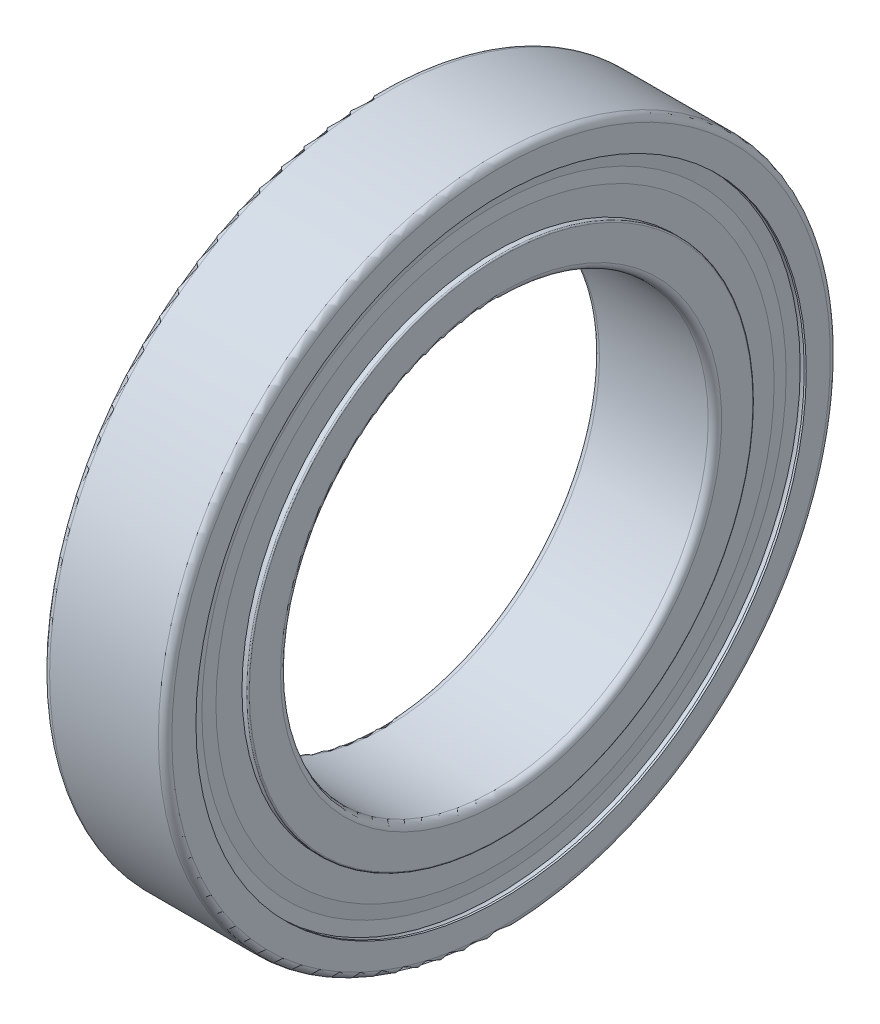
ISO-10303-21;
HEADER;
FILE_DESCRIPTION(('STEP AP214'),'2;1');
FILE_NAME('part.step','',(''),(''),'','','');
FILE_SCHEMA(('AUTOMOTIVE_DESIGN { 1 0 10303 214 1 1 1 1 }'));
ENDSEC;
DATA;
#1=APPLICATION_CONTEXT('core data for automotive mechanical design processes');
#2=APPLICATION_PROTOCOL_DEFINITION('international standard','automotive_design',2000,#1);
#3=PRODUCT_CONTEXT('',#1,'mechanical');
#4=PRODUCT('Part','Part','',(#3));
#5=PRODUCT_RELATED_PRODUCT_CATEGORY('part','',(#4));
#6=PRODUCT_DEFINITION_FORMATION('','',#4);
#7=PRODUCT_DEFINITION_CONTEXT('part definition',#1,'design');
#8=PRODUCT_DEFINITION('design','',#6,#7);
#9=PRODUCT_DEFINITION_SHAPE('','',#8);
#10=(LENGTH_UNIT() NAMED_UNIT(*) SI_UNIT(.MILLI.,.METRE.));
#11=(NAMED_UNIT(*) PLANE_ANGLE_UNIT() SI_UNIT($,.RADIAN.));
#12=(NAMED_UNIT(*) SI_UNIT($,.STERADIAN.) SOLID_ANGLE_UNIT());
#13=UNCERTAINTY_MEASURE_WITH_UNIT(LENGTH_MEASURE(1.E-05),#10,'distance_accuracy_value','');
#14=(GEOMETRIC_REPRESENTATION_CONTEXT(3) GLOBAL_UNCERTAINTY_ASSIGNED_CONTEXT((#13)) GLOBAL_UNIT_ASSIGNED_CONTEXT((#10,
#11,#12)) REPRESENTATION_CONTEXT('',''));
#15=CARTESIAN_POINT('',(0.,0.,0.));
#16=DIRECTION('',(0.,0.,1.));
#17=DIRECTION('',(1.,0.,0.));
#18=AXIS2_PLACEMENT_3D('',#15,#16,#17);
#19=CARTESIAN_POINT('',(10.,40.5435990556089,-19.5247682602901));
#20=DIRECTION('',(1.,0.,0.));
#21=DIRECTION('',(0.,-0.900968867902419,0.433883739117558));
#22=AXIS2_PLACEMENT_3D('',#19,#20,#21);
#23=SPHERICAL_SURFACE('',#22,5.953);
#24=CARTESIAN_POINT('',(15.953,40.5435990556089,-19.5247682602901));
#25=VERTEX_POINT('',#24);
#26=VERTEX_LOOP('',#25);
#27=FACE_BOUND('',#26,.T.);
#28=CARTESIAN_POINT('',(4.047,40.5435990556089,-19.5247682602901));
#29=VERTEX_POINT('',#28);
#30=VERTEX_LOOP('',#29);
#31=FACE_BOUND('',#30,.T.);
#32=ADVANCED_FACE('F46',(#27,#31),#23,.T.);
#33=CLOSED_SHELL('',(#32));
#34=MANIFOLD_SOLID_BREP('B2',#33);
#35=CARTESIAN_POINT('',(10.,28.057041083643,-35.1824167110614));
#36=DIRECTION('',(1.,0.,0.));
#37=DIRECTION('',(0.,-0.623489801858733,0.78183148246803));
#38=AXIS2_PLACEMENT_3D('',#35,#36,#37);
#39=SPHERICAL_SURFACE('',#38,5.953);
#40=CARTESIAN_POINT('',(15.953,28.057041083643,-35.1824167110614));
#41=VERTEX_POINT('',#40);
#42=VERTEX_LOOP('',#41);
#43=FACE_BOUND('',#42,.T.);
#44=CARTESIAN_POINT('',(4.047,28.057041083643,-35.1824167110614));
#45=VERTEX_POINT('',#44);
#46=VERTEX_LOOP('',#45);
#47=FACE_BOUND('',#46,.T.);
#48=ADVANCED_FACE('F73',(#43,#47),#39,.T.);
#49=CLOSED_SHELL('',(#48));
#50=MANIFOLD_SOLID_BREP('B6',#49);
#51=CARTESIAN_POINT('',(10.,10.0134420280342,-43.871756048182));
#52=DIRECTION('',(1.,0.,0.));
#53=DIRECTION('',(0.,-0.222520933956315,0.974927912181824));
#54=AXIS2_PLACEMENT_3D('',#51,#52,#53);
#55=SPHERICAL_SURFACE('',#54,5.953);
#56=CARTESIAN_POINT('',(15.953,10.0134420280342,-43.871756048182));
#57=VERTEX_POINT('',#56);
#58=VERTEX_LOOP('',#57);
#59=FACE_BOUND('',#58,.T.);
#60=CARTESIAN_POINT('',(4.047,10.0134420280342,-43.871756048182));
#61=VERTEX_POINT('',#60);
#62=VERTEX_LOOP('',#61);
#63=FACE_BOUND('',#62,.T.);
#64=ADVANCED_FACE('F100',(#59,#63),#55,.T.);
#65=CLOSED_SHELL('',(#64));
#66=MANIFOLD_SOLID_BREP('B40',#65);
#67=CARTESIAN_POINT('',(10.,-10.0134420280341,-43.8717560481821));
#68=DIRECTION('',(1.,0.,0.));
#69=DIRECTION('',(0.,0.222520933956314,0.974927912181824));
#70=AXIS2_PLACEMENT_3D('',#67,#68,#69);
#71=SPHERICAL_SURFACE('',#70,5.953);
#72=CARTESIAN_POINT('',(15.953,-10.0134420280341,-43.8717560481821));
#73=VERTEX_POINT('',#72);
#74=VERTEX_LOOP('',#73);
#75=FACE_BOUND('',#74,.T.);
#76=CARTESIAN_POINT('',(4.047,-10.0134420280341,-43.8717560481821));
#77=VERTEX_POINT('',#76);
#78=VERTEX_LOOP('',#77);
#79=FACE_BOUND('',#78,.T.);
#80=ADVANCED_FACE('F127',(#75,#79),#71,.T.);
#81=CLOSED_SHELL('',(#80));
#82=MANIFOLD_SOLID_BREP('B67',#81);
#83=CARTESIAN_POINT('',(10.,-28.057041083643,-35.1824167110613));
#84=DIRECTION('',(1.,0.,0.));
#85=DIRECTION('',(0.,0.623489801858734,0.78183148246803));
#86=AXIS2_PLACEMENT_3D('',#83,#84,#85);
#87=SPHERICAL_SURFACE('',#86,5.953);
#88=CARTESIAN_POINT('',(15.953,-28.057041083643,-35.1824167110613));
#89=VERTEX_POINT('',#88);
#90=VERTEX_LOOP('',#89);
#91=FACE_BOUND('',#90,.T.);
#92=CARTESIAN_POINT('',(4.047,-28.057041083643,-35.1824167110613));
#93=VERTEX_POINT('',#92);
#94=VERTEX_LOOP('',#93);
#95=FACE_BOUND('',#94,.T.);
#96=ADVANCED_FACE('F154',(#91,#95),#87,.T.);
#97=CLOSED_SHELL('',(#96));
#98=MANIFOLD_SOLID_BREP('B94',#97);
#99=CARTESIAN_POINT('',(10.,-40.5435990556089,-19.5247682602901));
#100=DIRECTION('',(1.,0.,0.));
#101=DIRECTION('',(0.,0.900968867902419,0.433883739117558));
#102=AXIS2_PLACEMENT_3D('',#99,#100,#101);
#103=SPHERICAL_SURFACE('',#102,5.953);
#104=CARTESIAN_POINT('',(15.953,-40.5435990556089,-19.5247682602901));
#105=VERTEX_POINT('',#104);
#106=VERTEX_LOOP('',#105);
#107=FACE_BOUND('',#106,.T.);
#108=CARTESIAN_POINT('',(4.047,-40.5435990556089,-19.5247682602901));
#109=VERTEX_POINT('',#108);
#110=VERTEX_LOOP('',#109);
#111=FACE_BOUND('',#110,.T.);
#112=ADVANCED_FACE('F181',(#107,#111),#103,.T.);
#113=CLOSED_SHELL('',(#112));
#114=MANIFOLD_SOLID_BREP('B121',#113);
#115=CARTESIAN_POINT('',(10.,-45.,0.));
#116=DIRECTION('',(1.,0.,0.));
#117=DIRECTION('',(0.,1.,0.));
#118=AXIS2_PLACEMENT_3D('',#115,#116,#117);
#119=SPHERICAL_SURFACE('',#118,5.953);
#120=CARTESIAN_POINT('',(15.953,-45.,0.));
#121=VERTEX_POINT('',#120);
#122=VERTEX_LOOP('',#121);
#123=FACE_BOUND('',#122,.T.);
#124=CARTESIAN_POINT('',(4.047,-45.,0.));
#125=VERTEX_POINT('',#124);
#126=VERTEX_LOOP('',#125);
#127=FACE_BOUND('',#126,.T.);
#128=ADVANCED_FACE('F208',(#123,#127),#119,.T.);
#129=CLOSED_SHELL('',(#128));
#130=MANIFOLD_SOLID_BREP('B148',#129);
#131=CARTESIAN_POINT('',(10.,-40.5435990556089,19.5247682602901));
#132=DIRECTION('',(1.,0.,0.));
#133=DIRECTION('',(0.,0.900968867902419,-0.433883739117558));
#134=AXIS2_PLACEMENT_3D('',#131,#132,#133);
#135=SPHERICAL_SURFACE('',#134,5.953);
#136=CARTESIAN_POINT('',(15.953,-40.5435990556089,19.5247682602901));
#137=VERTEX_POINT('',#136);
#138=VERTEX_LOOP('',#137);
#139=FACE_BOUND('',#138,.T.);
#140=CARTESIAN_POINT('',(4.047,-40.5435990556089,19.5247682602901));
#141=VERTEX_POINT('',#140);
#142=VERTEX_LOOP('',#141);
#143=FACE_BOUND('',#142,.T.);
#144=ADVANCED_FACE('F235',(#139,#143),#135,.T.);
#145=CLOSED_SHELL('',(#144));
#146=MANIFOLD_SOLID_BREP('B175',#145);
#147=CARTESIAN_POINT('',(10.,-28.057041083643,35.1824167110613));
#148=DIRECTION('',(1.,0.,0.));
#149=DIRECTION('',(0.,0.623489801858734,-0.78183148246803));
#150=AXIS2_PLACEMENT_3D('',#147,#148,#149);
#151=SPHERICAL_SURFACE('',#150,5.953);
#152=CARTESIAN_POINT('',(15.953,-28.057041083643,35.1824167110613));
#153=VERTEX_POINT('',#152);
#154=VERTEX_LOOP('',#153);
#155=FACE_BOUND('',#154,.T.);
#156=CARTESIAN_POINT('',(4.047,-28.057041083643,35.1824167110613));
#157=VERTEX_POINT('',#156);
#158=VERTEX_LOOP('',#157);
#159=FACE_BOUND('',#158,.T.);
#160=ADVANCED_FACE('F262',(#155,#159),#151,.T.);
#161=CLOSED_SHELL('',(#160));
#162=MANIFOLD_SOLID_BREP('B202',#161);
#163=CARTESIAN_POINT('',(10.,-10.0134420280341,43.8717560481821));
#164=DIRECTION('',(1.,0.,0.));
#165=DIRECTION('',(0.,0.222520933956314,-0.974927912181824));
#166=AXIS2_PLACEMENT_3D('',#163,#164,#165);
#167=SPHERICAL_SURFACE('',#166,5.953);
#168=CARTESIAN_POINT('',(15.953,-10.0134420280341,43.8717560481821));
#169=VERTEX_POINT('',#168);
#170=VERTEX_LOOP('',#169);
#171=FACE_BOUND('',#170,.T.);
#172=CARTESIAN_POINT('',(4.047,-10.0134420280341,43.8717560481821));
#173=VERTEX_POINT('',#172);
#174=VERTEX_LOOP('',#173);
#175=FACE_BOUND('',#174,.T.);
#176=ADVANCED_FACE('F289',(#171,#175),#167,.T.);
#177=CLOSED_SHELL('',(#176));
#178=MANIFOLD_SOLID_BREP('B229',#177);
#179=CARTESIAN_POINT('',(10.,10.0134420280341,43.8717560481821));
#180=DIRECTION('',(1.,0.,0.));
#181=DIRECTION('',(0.,-0.222520933956314,-0.974927912181824));
#182=AXIS2_PLACEMENT_3D('',#179,#180,#181);
#183=SPHERICAL_SURFACE('',#182,5.953);
#184=CARTESIAN_POINT('',(15.953,10.0134420280341,43.8717560481821));
#185=VERTEX_POINT('',#184);
#186=VERTEX_LOOP('',#185);
#187=FACE_BOUND('',#186,.T.);
#188=CARTESIAN_POINT('',(4.047,10.0134420280341,43.8717560481821));
#189=VERTEX_POINT('',#188);
#190=VERTEX_LOOP('',#189);
#191=FACE_BOUND('',#190,.T.);
#192=ADVANCED_FACE('F316',(#187,#191),#183,.T.);
#193=CLOSED_SHELL('',(#192));
#194=MANIFOLD_SOLID_BREP('B256',#193);
#195=CARTESIAN_POINT('',(10.,28.057041083643,35.1824167110613));
#196=DIRECTION('',(1.,0.,0.));
#197=DIRECTION('',(0.,-0.623489801858734,-0.78183148246803));
#198=AXIS2_PLACEMENT_3D('',#195,#196,#197);
#199=SPHERICAL_SURFACE('',#198,5.953);
#200=CARTESIAN_POINT('',(15.953,28.057041083643,35.1824167110613));
#201=VERTEX_POINT('',#200);
#202=VERTEX_LOOP('',#201);
#203=FACE_BOUND('',#202,.T.);
#204=CARTESIAN_POINT('',(4.047,28.057041083643,35.1824167110613));
#205=VERTEX_POINT('',#204);
#206=VERTEX_LOOP('',#205);
#207=FACE_BOUND('',#206,.T.);
#208=ADVANCED_FACE('F343',(#203,#207),#199,.T.);
#209=CLOSED_SHELL('',(#208));
#210=MANIFOLD_SOLID_BREP('B283',#209);
#211=CARTESIAN_POINT('',(10.,40.5435990556089,19.5247682602901));
#212=DIRECTION('',(1.,0.,0.));
#213=DIRECTION('',(0.,-0.900968867902419,-0.433883739117558));
#214=AXIS2_PLACEMENT_3D('',#211,#212,#213);
#215=SPHERICAL_SURFACE('',#214,5.953);
#216=CARTESIAN_POINT('',(15.953,40.5435990556089,19.5247682602901));
#217=VERTEX_POINT('',#216);
#218=VERTEX_LOOP('',#217);
#219=FACE_BOUND('',#218,.T.);
#220=CARTESIAN_POINT('',(4.047,40.5435990556089,19.5247682602901));
#221=VERTEX_POINT('',#220);
#222=VERTEX_LOOP('',#221);
#223=FACE_BOUND('',#222,.T.);
#224=ADVANCED_FACE('F370',(#219,#223),#215,.T.);
#225=CLOSED_SHELL('',(#224));
#226=MANIFOLD_SOLID_BREP('B310',#225);
#227=CARTESIAN_POINT('',(10.,45.,0.));
#228=DIRECTION('',(1.,0.,0.));
#229=DIRECTION('',(0.,-1.,0.));
#230=AXIS2_PLACEMENT_3D('',#227,#228,#229);
#231=SPHERICAL_SURFACE('',#230,5.953);
#232=CARTESIAN_POINT('',(15.953,45.,0.));
#233=VERTEX_POINT('',#232);
#234=VERTEX_LOOP('',#233);
#235=FACE_BOUND('',#234,.T.);
#236=CARTESIAN_POINT('',(4.047,45.,0.));
#237=VERTEX_POINT('',#236);
#238=VERTEX_LOOP('',#237);
#239=FACE_BOUND('',#238,.T.);
#240=ADVANCED_FACE('F399',(#235,#239),#231,.T.);
#241=CLOSED_SHELL('',(#240));
#242=MANIFOLD_SOLID_BREP('B337',#241);
#243=CARTESIAN_POINT('',(1.1,0.,0.));
#244=DIRECTION('',(1.,0.,0.));
#245=DIRECTION('',(0.,0.,1.));
#246=AXIS2_PLACEMENT_3D('',#243,#244,#245);
#247=TOROIDAL_SURFACE('',#246,53.9,1.1);
#248=CARTESIAN_POINT('',(1.1,0.,0.));
#249=DIRECTION('',(-1.,0.,0.));
#250=DIRECTION('',(0.,0.,1.));
#251=AXIS2_PLACEMENT_3D('',#248,#249,#250);
#252=CIRCLE('',#251,55.);
#253=CARTESIAN_POINT('',(1.1,0.,55.));
#254=VERTEX_POINT('',#253);
#255=EDGE_CURVE('E444',#254,#254,#252,.T.);
#256=ORIENTED_EDGE('',*,*,#255,.T.);
#257=EDGE_LOOP('',(#256));
#258=FACE_BOUND('',#257,.T.);
#259=CARTESIAN_POINT('',(0.,0.,0.));
#260=DIRECTION('',(-1.,0.,0.));
#261=DIRECTION('',(0.,0.,1.));
#262=AXIS2_PLACEMENT_3D('',#259,#260,#261);
#263=CIRCLE('',#262,53.9);
#264=CARTESIAN_POINT('',(0.,0.,53.9));
#265=VERTEX_POINT('',#264);
#266=EDGE_CURVE('E397',#265,#265,#263,.T.);
#267=ORIENTED_EDGE('',*,*,#266,.F.);
#268=EDGE_LOOP('',(#267));
#269=FACE_BOUND('',#268,.T.);
#270=ADVANCED_FACE('F427',(#258,#269),#247,.T.);
#271=CARTESIAN_POINT('',(0.,53.9,0.));
#272=DIRECTION('',(-1.,0.,0.));
#273=DIRECTION('',(0.,0.,-1.));
#274=AXIS2_PLACEMENT_3D('',#271,#272,#273);
#275=PLANE('',#274);
#276=ORIENTED_EDGE('',*,*,#266,.T.);
#277=EDGE_LOOP('',(#276));
#278=FACE_BOUND('',#277,.T.);
#279=CARTESIAN_POINT('',(0.,0.,0.));
#280=DIRECTION('',(-1.,0.,0.));
#281=DIRECTION('',(0.,0.,1.));
#282=AXIS2_PLACEMENT_3D('',#279,#280,#281);
#283=CIRCLE('',#282,49.95);
#284=CARTESIAN_POINT('',(0.,0.,49.95));
#285=VERTEX_POINT('',#284);
#286=EDGE_CURVE('E437',#285,#285,#283,.T.);
#287=ORIENTED_EDGE('',*,*,#286,.F.);
#288=EDGE_LOOP('',(#287));
#289=FACE_BOUND('',#288,.T.);
#290=ADVANCED_FACE('F545',(#278,#289),#275,.T.);
#291=CARTESIAN_POINT('',(50.,0.,0.));
#292=DIRECTION('',(-1.,0.,0.));
#293=DIRECTION('',(0.,0.,1.));
#294=AXIS2_PLACEMENT_3D('',#291,#292,#293);
#295=CYLINDRICAL_SURFACE('',#294,49.95);
#296=ORIENTED_EDGE('',*,*,#286,.T.);
#297=EDGE_LOOP('',(#296));
#298=FACE_BOUND('',#297,.T.);
#299=CARTESIAN_POINT('',(0.33,0.,0.));
#300=DIRECTION('',(-1.,0.,0.));
#301=DIRECTION('',(0.,0.,1.));
#302=AXIS2_PLACEMENT_3D('',#299,#300,#301);
#303=CIRCLE('',#302,49.95);
#304=CARTESIAN_POINT('',(0.33,0.,49.95));
#305=VERTEX_POINT('',#304);
#306=EDGE_CURVE('E507',#305,#305,#303,.T.);
#307=ORIENTED_EDGE('',*,*,#306,.F.);
#308=EDGE_LOOP('',(#307));
#309=FACE_BOUND('',#308,.T.);
#310=ADVANCED_FACE('F539',(#298,#309),#295,.F.);
#311=CARTESIAN_POINT('',(0.99,0.,0.));
#312=DIRECTION('',(1.,0.,0.));
#313=DIRECTION('',(0.,0.,1.));
#314=AXIS2_PLACEMENT_3D('',#311,#312,#313);
#315=TOROIDAL_SURFACE('',#314,49.9499999833,0.66);
#316=CARTESIAN_POINT('',(1.65,0.,0.));
#317=DIRECTION('',(-1.,0.,0.));
#318=DIRECTION('',(0.,0.,1.));
#319=AXIS2_PLACEMENT_3D('',#316,#317,#318);
#320=CIRCLE('',#319,49.95);
#321=CARTESIAN_POINT('',(1.65,0.,49.95));
#322=VERTEX_POINT('',#321);
#323=EDGE_CURVE('E509',#322,#322,#320,.T.);
#324=ORIENTED_EDGE('',*,*,#323,.F.);
#325=EDGE_LOOP('',(#324));
#326=FACE_BOUND('',#325,.T.);
#327=ORIENTED_EDGE('',*,*,#306,.T.);
#328=EDGE_LOOP('',(#327));
#329=FACE_BOUND('',#328,.T.);
#330=CARTESIAN_POINT('',(0.99,0.,50.60999998334));
#331=VERTEX_POINT('',#330);
#332=VERTEX_LOOP('',#331);
#333=FACE_BOUND('',#332,.T.);
#334=ADVANCED_FACE('F531',(#326,#329,#333),#315,.F.);
#335=CARTESIAN_POINT('',(1.65,0.,0.));
#336=DIRECTION('',(-1.,0.,0.));
#337=DIRECTION('',(0.,0.,-1.));
#338=AXIS2_PLACEMENT_3D('',#335,#336,#337);
#339=CONICAL_SURFACE('',#338,49.95,1.3962634016);
#340=ORIENTED_EDGE('',*,*,#323,.T.);
#341=EDGE_LOOP('',(#340));
#342=FACE_BOUND('',#341,.T.);
#343=CARTESIAN_POINT('',(1.81945022846084,0.,0.));
#344=DIRECTION('',(-1.,0.,0.));
#345=DIRECTION('',(0.,0.,1.));
#346=AXIS2_PLACEMENT_3D('',#343,#344,#345);
#347=CIRCLE('',#346,48.989);
#348=CARTESIAN_POINT('',(1.81945022846084,0.,48.989));
#349=VERTEX_POINT('',#348);
#350=EDGE_CURVE('E505',#349,#349,#347,.T.);
#351=ORIENTED_EDGE('',*,*,#350,.F.);
#352=EDGE_LOOP('',(#351));
#353=FACE_BOUND('',#352,.T.);
#354=ADVANCED_FACE('F529',(#342,#353),#339,.F.);
#355=CARTESIAN_POINT('',(50.,0.,0.));
#356=DIRECTION('',(-1.,0.,0.));
#357=DIRECTION('',(0.,0.,1.));
#358=AXIS2_PLACEMENT_3D('',#355,#356,#357);
#359=CYLINDRICAL_SURFACE('',#358,48.989);
#360=ORIENTED_EDGE('',*,*,#350,.T.);
#361=EDGE_LOOP('',(#360));
#362=FACE_BOUND('',#361,.T.);
#363=CARTESIAN_POINT('',(5.58116666980978,0.,0.));
#364=DIRECTION('',(-1.,0.,0.));
#365=DIRECTION('',(0.,0.,1.));
#366=AXIS2_PLACEMENT_3D('',#363,#364,#365);
#367=CIRCLE('',#366,48.989);
#368=CARTESIAN_POINT('',(5.58116666980978,0.,48.989));
#369=VERTEX_POINT('',#368);
#370=EDGE_CURVE('E510',#369,#369,#367,.T.);
#371=ORIENTED_EDGE('',*,*,#370,.F.);
#372=EDGE_LOOP('',(#371));
#373=FACE_BOUND('',#372,.T.);
#374=ADVANCED_FACE('F526',(#362,#373),#359,.F.);
#375=CARTESIAN_POINT('',(10.,0.,0.));
#376=DIRECTION('',(1.,0.,0.));
#377=DIRECTION('',(0.,0.,1.));
#378=AXIS2_PLACEMENT_3D('',#375,#376,#377);
#379=TOROIDAL_SURFACE('',#378,45.,5.953);
#380=CARTESIAN_POINT('',(14.4188333301902,0.,0.));
#381=DIRECTION('',(-1.,0.,0.));
#382=DIRECTION('',(0.,0.,1.));
#383=AXIS2_PLACEMENT_3D('',#380,#381,#382);
#384=CIRCLE('',#383,48.989);
#385=CARTESIAN_POINT('',(14.4188333301902,0.,48.989));
#386=VERTEX_POINT('',#385);
#387=EDGE_CURVE('E468',#386,#386,#384,.T.);
#388=ORIENTED_EDGE('',*,*,#387,.F.);
#389=EDGE_LOOP('',(#388));
#390=FACE_BOUND('',#389,.T.);
#391=ORIENTED_EDGE('',*,*,#370,.T.);
#392=EDGE_LOOP('',(#391));
#393=FACE_BOUND('',#392,.T.);
#394=CARTESIAN_POINT('',(10.,0.,50.953));
#395=VERTEX_POINT('',#394);
#396=VERTEX_LOOP('',#395);
#397=FACE_BOUND('',#396,.T.);
#398=ADVANCED_FACE('F537',(#390,#393,#397),#379,.F.);
#399=CARTESIAN_POINT('',(50.,0.,0.));
#400=DIRECTION('',(-1.,0.,0.));
#401=DIRECTION('',(0.,0.,1.));
#402=AXIS2_PLACEMENT_3D('',#399,#400,#401);
#403=CYLINDRICAL_SURFACE('',#402,48.989);
#404=ORIENTED_EDGE('',*,*,#387,.T.);
#405=EDGE_LOOP('',(#404));
#406=FACE_BOUND('',#405,.T.);
#407=CARTESIAN_POINT('',(18.1805497715392,0.,0.));
#408=DIRECTION('',(-1.,0.,0.));
#409=DIRECTION('',(0.,0.,1.));
#410=AXIS2_PLACEMENT_3D('',#407,#408,#409);
#411=CIRCLE('',#410,48.989);
#412=CARTESIAN_POINT('',(18.1805497715392,0.,48.989));
#413=VERTEX_POINT('',#412);
#414=EDGE_CURVE('E511',#413,#413,#411,.T.);
#415=ORIENTED_EDGE('',*,*,#414,.F.);
#416=EDGE_LOOP('',(#415));
#417=FACE_BOUND('',#416,.T.);
#418=ADVANCED_FACE('F429',(#406,#417),#403,.F.);
#419=CARTESIAN_POINT('',(18.1805497715392,0.,0.));
#420=DIRECTION('',(1.,0.,0.));
#421=DIRECTION('',(0.,0.,1.));
#422=AXIS2_PLACEMENT_3D('',#419,#420,#421);
#423=CONICAL_SURFACE('',#422,48.989,1.3962634016);
#424=CARTESIAN_POINT('',(18.35,0.,0.));
#425=DIRECTION('',(-1.,0.,0.));
#426=DIRECTION('',(0.,0.,1.));
#427=AXIS2_PLACEMENT_3D('',#424,#425,#426);
#428=CIRCLE('',#427,49.95);
#429=CARTESIAN_POINT('',(18.35,0.,49.95));
#430=VERTEX_POINT('',#429);
#431=EDGE_CURVE('E496',#430,#430,#428,.T.);
#432=ORIENTED_EDGE('',*,*,#431,.F.);
#433=EDGE_LOOP('',(#432));
#434=FACE_BOUND('',#433,.T.);
#435=ORIENTED_EDGE('',*,*,#414,.T.);
#436=EDGE_LOOP('',(#435));
#437=FACE_BOUND('',#436,.T.);
#438=ADVANCED_FACE('F558',(#434,#437),#423,.F.);
#439=CARTESIAN_POINT('',(19.01,0.,0.));
#440=DIRECTION('',(1.,0.,0.));
#441=DIRECTION('',(0.,0.,1.));
#442=AXIS2_PLACEMENT_3D('',#439,#440,#441);
#443=TOROIDAL_SURFACE('',#442,49.95,0.66);
#444=CARTESIAN_POINT('',(19.67,0.,0.));
#445=DIRECTION('',(-1.,0.,0.));
#446=DIRECTION('',(0.,0.,1.));
#447=AXIS2_PLACEMENT_3D('',#444,#445,#446);
#448=CIRCLE('',#447,49.95);
#449=CARTESIAN_POINT('',(19.67,0.,49.95));
#450=VERTEX_POINT('',#449);
#451=EDGE_CURVE('E494',#450,#450,#448,.T.);
#452=ORIENTED_EDGE('',*,*,#451,.F.);
#453=EDGE_LOOP('',(#452));
#454=FACE_BOUND('',#453,.T.);
#455=ORIENTED_EDGE('',*,*,#431,.T.);
#456=EDGE_LOOP('',(#455));
#457=FACE_BOUND('',#456,.T.);
#458=CARTESIAN_POINT('',(19.01,0.,50.61));
#459=VERTEX_POINT('',#458);
#460=VERTEX_LOOP('',#459);
#461=FACE_BOUND('',#460,.T.);
#462=ADVANCED_FACE('F556',(#454,#457,#461),#443,.F.);
#463=CARTESIAN_POINT('',(50.,0.,0.));
#464=DIRECTION('',(-1.,0.,0.));
#465=DIRECTION('',(0.,0.,1.));
#466=AXIS2_PLACEMENT_3D('',#463,#464,#465);
#467=CYLINDRICAL_SURFACE('',#466,49.95);
#468=ORIENTED_EDGE('',*,*,#451,.T.);
#469=EDGE_LOOP('',(#468));
#470=FACE_BOUND('',#469,.T.);
#471=CARTESIAN_POINT('',(20.,0.,0.));
#472=DIRECTION('',(-1.,0.,0.));
#473=DIRECTION('',(0.,0.,1.));
#474=AXIS2_PLACEMENT_3D('',#471,#472,#473);
#475=CIRCLE('',#474,49.95);
#476=CARTESIAN_POINT('',(20.,0.,49.95));
#477=VERTEX_POINT('',#476);
#478=EDGE_CURVE('E431',#477,#477,#475,.T.);
#479=ORIENTED_EDGE('',*,*,#478,.F.);
#480=EDGE_LOOP('',(#479));
#481=FACE_BOUND('',#480,.T.);
#482=ADVANCED_FACE('F554',(#470,#481),#467,.F.);
#483=CARTESIAN_POINT('',(20.,49.95,0.));
#484=DIRECTION('',(1.,0.,0.));
#485=DIRECTION('',(0.,1.,0.));
#486=AXIS2_PLACEMENT_3D('',#483,#484,#485);
#487=PLANE('',#486);
#488=CARTESIAN_POINT('',(20.,0.,0.));
#489=DIRECTION('',(-1.,0.,0.));
#490=DIRECTION('',(0.,0.,1.));
#491=AXIS2_PLACEMENT_3D('',#488,#489,#490);
#492=CIRCLE('',#491,53.9);
#493=CARTESIAN_POINT('',(20.,0.,53.9));
#494=VERTEX_POINT('',#493);
#495=EDGE_CURVE('E495',#494,#494,#492,.T.);
#496=ORIENTED_EDGE('',*,*,#495,.F.);
#497=EDGE_LOOP('',(#496));
#498=FACE_BOUND('',#497,.T.);
#499=ORIENTED_EDGE('',*,*,#478,.T.);
#500=EDGE_LOOP('',(#499));
#501=FACE_BOUND('',#500,.T.);
#502=ADVANCED_FACE('F492',(#498,#501),#487,.T.);
#503=CARTESIAN_POINT('',(18.9,0.,0.));
#504=DIRECTION('',(1.,0.,0.));
#505=DIRECTION('',(0.,0.,1.));
#506=AXIS2_PLACEMENT_3D('',#503,#504,#505);
#507=TOROIDAL_SURFACE('',#506,53.9,1.1);
#508=ORIENTED_EDGE('',*,*,#495,.T.);
#509=EDGE_LOOP('',(#508));
#510=FACE_BOUND('',#509,.T.);
#511=CARTESIAN_POINT('',(18.9,0.,0.));
#512=DIRECTION('',(-1.,0.,0.));
#513=DIRECTION('',(0.,0.,1.));
#514=AXIS2_PLACEMENT_3D('',#511,#512,#513);
#515=CIRCLE('',#514,55.);
#516=CARTESIAN_POINT('',(18.9,0.,55.));
#517=VERTEX_POINT('',#516);
#518=EDGE_CURVE('E498',#517,#517,#515,.T.);
#519=ORIENTED_EDGE('',*,*,#518,.F.);
#520=EDGE_LOOP('',(#519));
#521=FACE_BOUND('',#520,.T.);
#522=ADVANCED_FACE('F562',(#510,#521),#507,.T.);
#523=CARTESIAN_POINT('',(50.,0.,0.));
#524=DIRECTION('',(-1.,0.,0.));
#525=DIRECTION('',(0.,0.,1.));
#526=AXIS2_PLACEMENT_3D('',#523,#524,#525);
#527=CYLINDRICAL_SURFACE('',#526,55.);
#528=ORIENTED_EDGE('',*,*,#518,.T.);
#529=EDGE_LOOP('',(#528));
#530=FACE_BOUND('',#529,.T.);
#531=ORIENTED_EDGE('',*,*,#255,.F.);
#532=EDGE_LOOP('',(#531));
#533=FACE_BOUND('',#532,.T.);
#534=ADVANCED_FACE('F560',(#530,#533),#527,.T.);
#535=CLOSED_SHELL('',(#270,#290,#310,#334,#354,#374,#398,#418,#438,#462,#482,#502,#522,#534));
#536=MANIFOLD_SOLID_BREP('B364',#535);
#537=CARTESIAN_POINT('',(18.68,0.,0.));
#538=DIRECTION('',(1.,0.,0.));
#539=DIRECTION('',(0.,0.,1.));
#540=AXIS2_PLACEMENT_3D('',#537,#538,#539);
#541=CONICAL_SURFACE('',#540,49.95,1.4173547102);
#542=CARTESIAN_POINT('',(18.68,0.,0.));
#543=DIRECTION('',(-1.,0.,0.));
#544=DIRECTION('',(0.,0.,1.));
#545=AXIS2_PLACEMENT_3D('',#542,#543,#544);
#546=CIRCLE('',#545,49.95);
#547=CARTESIAN_POINT('',(18.68,0.,49.95));
#548=VERTEX_POINT('',#547);
#549=EDGE_CURVE('E681',#548,#548,#546,.T.);
#550=ORIENTED_EDGE('',*,*,#549,.T.);
#551=EDGE_LOOP('',(#550));
#552=FACE_BOUND('',#551,.T.);
#553=CARTESIAN_POINT('',(18.35,0.,0.));
#554=DIRECTION('',(-1.,0.,0.));
#555=DIRECTION('',(0.,0.,1.));
#556=AXIS2_PLACEMENT_3D('',#553,#554,#555);
#557=CIRCLE('',#556,47.81625);
#558=CARTESIAN_POINT('',(18.35,0.,47.81625));
#559=VERTEX_POINT('',#558);
#560=EDGE_CURVE('E425',#559,#559,#557,.T.);
#561=ORIENTED_EDGE('',*,*,#560,.F.);
#562=EDGE_LOOP('',(#561));
#563=FACE_BOUND('',#562,.T.);
#564=ADVANCED_FACE('F677',(#552,#563),#541,.T.);
#565=CARTESIAN_POINT('',(18.35,47.81625,0.));
#566=DIRECTION('',(-1.,0.,0.));
#567=DIRECTION('',(0.,0.,-1.));
#568=AXIS2_PLACEMENT_3D('',#565,#566,#567);
#569=PLANE('',#568);
#570=ORIENTED_EDGE('',*,*,#560,.T.);
#571=EDGE_LOOP('',(#570));
#572=FACE_BOUND('',#571,.T.);
#573=CARTESIAN_POINT('',(18.35,0.,0.));
#574=DIRECTION('',(-1.,0.,0.));
#575=DIRECTION('',(0.,0.,1.));
#576=AXIS2_PLACEMENT_3D('',#573,#574,#575);
#577=CIRCLE('',#576,45.6825);
#578=CARTESIAN_POINT('',(18.35,0.,45.6825));
#579=VERTEX_POINT('',#578);
#580=EDGE_CURVE('E687',#579,#579,#577,.T.);
#581=ORIENTED_EDGE('',*,*,#580,.F.);
#582=EDGE_LOOP('',(#581));
#583=FACE_BOUND('',#582,.T.);
#584=ADVANCED_FACE('F842',(#572,#583),#569,.T.);
#585=CARTESIAN_POINT('',(1.65,0.,0.));
#586=DIRECTION('',(-1.,0.,0.));
#587=DIRECTION('',(0.,0.,-1.));
#588=AXIS2_PLACEMENT_3D('',#585,#586,#587);
#589=CONICAL_SURFACE('',#588,47.81625,1.4173547102);
#590=CARTESIAN_POINT('',(1.32,0.,0.));
#591=DIRECTION('',(-1.,0.,0.));
#592=DIRECTION('',(0.,0.,1.));
#593=AXIS2_PLACEMENT_3D('',#590,#591,#592);
#594=CIRCLE('',#593,49.95);
#595=CARTESIAN_POINT('',(1.32,0.,49.95));
#596=VERTEX_POINT('',#595);
#597=EDGE_CURVE('E791',#596,#596,#594,.T.);
#598=ORIENTED_EDGE('',*,*,#597,.F.);
#599=EDGE_LOOP('',(#598));
#600=FACE_BOUND('',#599,.T.);
#601=CARTESIAN_POINT('',(1.65,0.,0.));
#602=DIRECTION('',(-1.,0.,0.));
#603=DIRECTION('',(0.,0.,1.));
#604=AXIS2_PLACEMENT_3D('',#601,#602,#603);
#605=CIRCLE('',#604,47.81625);
#606=CARTESIAN_POINT('',(1.65,0.,47.81625));
#607=VERTEX_POINT('',#606);
#608=EDGE_CURVE('E788',#607,#607,#605,.T.);
#609=ORIENTED_EDGE('',*,*,#608,.T.);
#610=EDGE_LOOP('',(#609));
#611=FACE_BOUND('',#610,.T.);
#612=ADVANCED_FACE('F846',(#600,#611),#589,.T.);
#613=CARTESIAN_POINT('',(50.,0.,0.));
#614=DIRECTION('',(-1.,0.,0.));
#615=DIRECTION('',(0.,0.,1.));
#616=AXIS2_PLACEMENT_3D('',#613,#614,#615);
#617=CYLINDRICAL_SURFACE('',#616,41.425);
#618=CARTESIAN_POINT('',(18.6792267135325,0.,0.));
#619=DIRECTION('',(-1.,0.,0.));
#620=DIRECTION('',(0.,0.,-1.));
#621=AXIS2_PLACEMENT_3D('',#618,#619,#620);
#622=CIRCLE('',#621,41.425);
#623=CARTESIAN_POINT('',(18.6792267135325,0.,-41.425));
#624=VERTEX_POINT('',#623);
#625=EDGE_CURVE('E806',#624,#624,#622,.T.);
#626=ORIENTED_EDGE('',*,*,#625,.T.);
#627=EDGE_LOOP('',(#626));
#628=FACE_BOUND('',#627,.T.);
#629=CARTESIAN_POINT('',(14.7599983193274,0.,0.));
#630=DIRECTION('',(-1.,0.,0.));
#631=DIRECTION('',(0.,0.,1.));
#632=AXIS2_PLACEMENT_3D('',#629,#630,#631);
#633=CIRCLE('',#632,41.425);
#634=CARTESIAN_POINT('',(14.7599983193274,0.,41.425));
#635=VERTEX_POINT('',#634);
#636=EDGE_CURVE('E789',#635,#635,#633,.T.);
#637=ORIENTED_EDGE('',*,*,#636,.F.);
#638=EDGE_LOOP('',(#637));
#639=FACE_BOUND('',#638,.T.);
#640=ADVANCED_FACE('F876',(#628,#639),#617,.T.);
#641=CARTESIAN_POINT('',(50.,0.,0.));
#642=DIRECTION('',(-1.,0.,0.));
#643=DIRECTION('',(0.,0.,1.));
#644=AXIS2_PLACEMENT_3D('',#641,#642,#643);
#645=CYLINDRICAL_SURFACE('',#644,41.425);
#646=CARTESIAN_POINT('',(0.99,0.,0.));
#647=DIRECTION('',(-1.,0.,0.));
#648=DIRECTION('',(0.,0.,-1.));
#649=AXIS2_PLACEMENT_3D('',#646,#647,#648);
#650=CIRCLE('',#649,41.425);
#651=CARTESIAN_POINT('',(0.99,0.,-41.425));
#652=VERTEX_POINT('',#651);
#653=EDGE_CURVE('E779',#652,#652,#650,.T.);
#654=ORIENTED_EDGE('',*,*,#653,.T.);
#655=EDGE_LOOP('',(#654));
#656=FACE_BOUND('',#655,.T.);
#657=CARTESIAN_POINT('',(0.22,0.,0.));
#658=DIRECTION('',(-1.,0.,0.));
#659=DIRECTION('',(0.,0.,1.));
#660=AXIS2_PLACEMENT_3D('',#657,#658,#659);
#661=CIRCLE('',#660,41.425);
#662=CARTESIAN_POINT('',(0.22,0.,41.425));
#663=VERTEX_POINT('',#662);
#664=EDGE_CURVE('E792',#663,#663,#661,.T.);
#665=ORIENTED_EDGE('',*,*,#664,.F.);
#666=EDGE_LOOP('',(#665));
#667=FACE_BOUND('',#666,.T.);
#668=ADVANCED_FACE('F878',(#656,#667),#645,.T.);
#669=CARTESIAN_POINT('',(50.,0.,0.));
#670=DIRECTION('',(-1.,0.,0.));
#671=DIRECTION('',(0.,0.,1.));
#672=AXIS2_PLACEMENT_3D('',#669,#670,#671);
#673=CYLINDRICAL_SURFACE('',#672,41.425);
#674=CARTESIAN_POINT('',(19.78,0.,0.));
#675=DIRECTION('',(-1.,0.,0.));
#676=DIRECTION('',(0.,0.,1.));
#677=AXIS2_PLACEMENT_3D('',#674,#675,#676);
#678=CIRCLE('',#677,41.425);
#679=CARTESIAN_POINT('',(19.78,0.,41.425));
#680=VERTEX_POINT('',#679);
#681=EDGE_CURVE('E796',#680,#680,#678,.T.);
#682=ORIENTED_EDGE('',*,*,#681,.T.);
#683=EDGE_LOOP('',(#682));
#684=FACE_BOUND('',#683,.T.);
#685=CARTESIAN_POINT('',(19.01,0.,0.));
#686=DIRECTION('',(1.,0.,0.));
#687=DIRECTION('',(0.,0.,1.));
#688=AXIS2_PLACEMENT_3D('',#685,#686,#687);
#689=CIRCLE('',#688,41.425);
#690=CARTESIAN_POINT('',(19.01,0.,41.425));
#691=VERTEX_POINT('',#690);
#692=EDGE_CURVE('E772',#691,#691,#689,.T.);
#693=ORIENTED_EDGE('',*,*,#692,.T.);
#694=EDGE_LOOP('',(#693));
#695=FACE_BOUND('',#694,.T.);
#696=ADVANCED_FACE('F872',(#684,#695),#673,.T.);
#697=CARTESIAN_POINT('',(10.,0.,0.));
#698=DIRECTION('',(1.,0.,0.));
#699=DIRECTION('',(0.,0.,1.));
#700=AXIS2_PLACEMENT_3D('',#697,#698,#699);
#701=TOROIDAL_SURFACE('',#700,45.,5.953);
#702=CARTESIAN_POINT('',(5.24000168067257,0.,0.));
#703=DIRECTION('',(-1.,0.,0.));
#704=DIRECTION('',(0.,0.,1.));
#705=AXIS2_PLACEMENT_3D('',#702,#703,#704);
#706=CIRCLE('',#705,41.425);
#707=CARTESIAN_POINT('',(5.24000168067257,0.,41.425));
#708=VERTEX_POINT('',#707);
#709=EDGE_CURVE('E798',#708,#708,#706,.T.);
#710=ORIENTED_EDGE('',*,*,#709,.F.);
#711=EDGE_LOOP('',(#710));
#712=FACE_BOUND('',#711,.T.);
#713=ORIENTED_EDGE('',*,*,#636,.T.);
#714=EDGE_LOOP('',(#713));
#715=FACE_BOUND('',#714,.T.);
#716=ADVANCED_FACE('F869',(#712,#715),#701,.F.);
#717=CARTESIAN_POINT('',(19.78,0.,0.));
#718=DIRECTION('',(1.,0.,0.));
#719=DIRECTION('',(0.,0.,1.));
#720=AXIS2_PLACEMENT_3D('',#717,#718,#719);
#721=TOROIDAL_SURFACE('',#720,41.205,0.22);
#722=CARTESIAN_POINT('',(20.,0.,0.));
#723=DIRECTION('',(-1.,0.,0.));
#724=DIRECTION('',(0.,0.,1.));
#725=AXIS2_PLACEMENT_3D('',#722,#723,#724);
#726=CIRCLE('',#725,41.205);
#727=CARTESIAN_POINT('',(20.,0.,41.205));
#728=VERTEX_POINT('',#727);
#729=EDGE_CURVE('E799',#728,#728,#726,.T.);
#730=ORIENTED_EDGE('',*,*,#729,.T.);
#731=EDGE_LOOP('',(#730));
#732=FACE_BOUND('',#731,.T.);
#733=ORIENTED_EDGE('',*,*,#681,.F.);
#734=EDGE_LOOP('',(#733));
#735=FACE_BOUND('',#734,.T.);
#736=ADVANCED_FACE('F836',(#732,#735),#721,.T.);
#737=CARTESIAN_POINT('',(20.,36.1,0.));
#738=DIRECTION('',(1.,0.,0.));
#739=DIRECTION('',(0.,1.,0.));
#740=AXIS2_PLACEMENT_3D('',#737,#738,#739);
#741=PLANE('',#740);
#742=ORIENTED_EDGE('',*,*,#729,.F.);
#743=EDGE_LOOP('',(#742));
#744=FACE_BOUND('',#743,.T.);
#745=CARTESIAN_POINT('',(20.,0.,0.));
#746=DIRECTION('',(-1.,0.,0.));
#747=DIRECTION('',(0.,0.,1.));
#748=AXIS2_PLACEMENT_3D('',#745,#746,#747);
#749=CIRCLE('',#748,36.1);
#750=CARTESIAN_POINT('',(20.,0.,36.1));
#751=VERTEX_POINT('',#750);
#752=EDGE_CURVE('E783',#751,#751,#749,.T.);
#753=ORIENTED_EDGE('',*,*,#752,.T.);
#754=EDGE_LOOP('',(#753));
#755=FACE_BOUND('',#754,.T.);
#756=ADVANCED_FACE('F822',(#744,#755),#741,.T.);
#757=CARTESIAN_POINT('',(18.9,0.,0.));
#758=DIRECTION('',(1.,0.,0.));
#759=DIRECTION('',(0.,0.,1.));
#760=AXIS2_PLACEMENT_3D('',#757,#758,#759);
#761=TOROIDAL_SURFACE('',#760,36.1,1.1);
#762=CARTESIAN_POINT('',(18.9,0.,0.));
#763=DIRECTION('',(-1.,0.,0.));
#764=DIRECTION('',(0.,0.,1.));
#765=AXIS2_PLACEMENT_3D('',#762,#763,#764);
#766=CIRCLE('',#765,35.);
#767=CARTESIAN_POINT('',(18.9,0.,35.));
#768=VERTEX_POINT('',#767);
#769=EDGE_CURVE('E781',#768,#768,#766,.T.);
#770=ORIENTED_EDGE('',*,*,#769,.T.);
#771=EDGE_LOOP('',(#770));
#772=FACE_BOUND('',#771,.T.);
#773=ORIENTED_EDGE('',*,*,#752,.F.);
#774=EDGE_LOOP('',(#773));
#775=FACE_BOUND('',#774,.T.);
#776=ADVANCED_FACE('F824',(#772,#775),#761,.T.);
#777=CARTESIAN_POINT('',(50.,0.,0.));
#778=DIRECTION('',(-1.,0.,0.));
#779=DIRECTION('',(0.,0.,1.));
#780=AXIS2_PLACEMENT_3D('',#777,#778,#779);
#781=CYLINDRICAL_SURFACE('',#780,35.);
#782=CARTESIAN_POINT('',(1.1,0.,0.));
#783=DIRECTION('',(-1.,0.,0.));
#784=DIRECTION('',(0.,0.,1.));
#785=AXIS2_PLACEMENT_3D('',#782,#783,#784);
#786=CIRCLE('',#785,35.);
#787=CARTESIAN_POINT('',(1.1,0.,35.));
#788=VERTEX_POINT('',#787);
#789=EDGE_CURVE('E784',#788,#788,#786,.T.);
#790=ORIENTED_EDGE('',*,*,#789,.T.);
#791=EDGE_LOOP('',(#790));
#792=FACE_BOUND('',#791,.T.);
#793=ORIENTED_EDGE('',*,*,#769,.F.);
#794=EDGE_LOOP('',(#793));
#795=FACE_BOUND('',#794,.T.);
#796=ADVANCED_FACE('F826',(#792,#795),#781,.F.);
#797=CARTESIAN_POINT('',(1.09999999999998,0.,0.));
#798=DIRECTION('',(1.,0.,0.));
#799=DIRECTION('',(0.,0.,1.));
#800=AXIS2_PLACEMENT_3D('',#797,#798,#799);
#801=TOROIDAL_SURFACE('',#800,36.1,1.1);
#802=CARTESIAN_POINT('',(0.,0.,0.));
#803=DIRECTION('',(-1.,0.,0.));
#804=DIRECTION('',(0.,0.,1.));
#805=AXIS2_PLACEMENT_3D('',#802,#803,#804);
#806=CIRCLE('',#805,36.1);
#807=CARTESIAN_POINT('',(0.,0.,36.1));
#808=VERTEX_POINT('',#807);
#809=EDGE_CURVE('E795',#808,#808,#806,.T.);
#810=ORIENTED_EDGE('',*,*,#809,.T.);
#811=EDGE_LOOP('',(#810));
#812=FACE_BOUND('',#811,.T.);
#813=ORIENTED_EDGE('',*,*,#789,.F.);
#814=EDGE_LOOP('',(#813));
#815=FACE_BOUND('',#814,.T.);
#816=ADVANCED_FACE('F833',(#812,#815),#801,.T.);
#817=CARTESIAN_POINT('',(0.,41.205,0.));
#818=DIRECTION('',(-1.,0.,0.));
#819=DIRECTION('',(0.,0.,-1.));
#820=AXIS2_PLACEMENT_3D('',#817,#818,#819);
#821=PLANE('',#820);
#822=CARTESIAN_POINT('',(0.,0.,0.));
#823=DIRECTION('',(-1.,0.,0.));
#824=DIRECTION('',(0.,0.,1.));
#825=AXIS2_PLACEMENT_3D('',#822,#823,#824);
#826=CIRCLE('',#825,41.205);
#827=CARTESIAN_POINT('',(0.,0.,41.205));
#828=VERTEX_POINT('',#827);
#829=EDGE_CURVE('E793',#828,#828,#826,.T.);
#830=ORIENTED_EDGE('',*,*,#829,.T.);
#831=EDGE_LOOP('',(#830));
#832=FACE_BOUND('',#831,.T.);
#833=ORIENTED_EDGE('',*,*,#809,.F.);
#834=EDGE_LOOP('',(#833));
#835=FACE_BOUND('',#834,.T.);
#836=ADVANCED_FACE('F889',(#832,#835),#821,.T.);
#837=CARTESIAN_POINT('',(0.220000000000006,0.,0.));
#838=DIRECTION('',(1.,0.,0.));
#839=DIRECTION('',(0.,0.,1.));
#840=AXIS2_PLACEMENT_3D('',#837,#838,#839);
#841=TOROIDAL_SURFACE('',#840,41.205,0.22);
#842=ORIENTED_EDGE('',*,*,#664,.T.);
#843=EDGE_LOOP('',(#842));
#844=FACE_BOUND('',#843,.T.);
#845=ORIENTED_EDGE('',*,*,#829,.F.);
#846=EDGE_LOOP('',(#845));
#847=FACE_BOUND('',#846,.T.);
#848=ADVANCED_FACE('F979',(#844,#847),#841,.T.);
#849=CARTESIAN_POINT('',(0.99,45.6825,0.));
#850=DIRECTION('',(-1.,0.,0.));
#851=DIRECTION('',(0.,0.,-1.));
#852=AXIS2_PLACEMENT_3D('',#849,#850,#851);
#853=PLANE('',#852);
#854=CARTESIAN_POINT('',(0.99,0.,0.));
#855=DIRECTION('',(-1.,0.,0.));
#856=DIRECTION('',(0.,0.,1.));
#857=AXIS2_PLACEMENT_3D('',#854,#855,#856);
#858=CIRCLE('',#857,45.6825);
#859=CARTESIAN_POINT('',(0.99,0.,45.6825));
#860=VERTEX_POINT('',#859);
#861=EDGE_CURVE('E803',#860,#860,#858,.T.);
#862=ORIENTED_EDGE('',*,*,#861,.T.);
#863=EDGE_LOOP('',(#862));
#864=FACE_BOUND('',#863,.T.);
#865=ORIENTED_EDGE('',*,*,#653,.F.);
#866=EDGE_LOOP('',(#865));
#867=FACE_BOUND('',#866,.T.);
#868=ADVANCED_FACE('F969',(#864,#867),#853,.T.);
#869=CARTESIAN_POINT('',(1.155,0.,0.));
#870=DIRECTION('',(1.,0.,0.));
#871=DIRECTION('',(0.,0.,1.));
#872=AXIS2_PLACEMENT_3D('',#869,#870,#871);
#873=CONICAL_SURFACE('',#872,47.81625,1.4936212639);
#874=CARTESIAN_POINT('',(1.155,0.,0.));
#875=DIRECTION('',(-1.,0.,0.));
#876=DIRECTION('',(0.,0.,1.));
#877=AXIS2_PLACEMENT_3D('',#874,#875,#876);
#878=CIRCLE('',#877,47.81625);
#879=CARTESIAN_POINT('',(1.155,0.,47.81625));
#880=VERTEX_POINT('',#879);
#881=EDGE_CURVE('E787',#880,#880,#878,.T.);
#882=ORIENTED_EDGE('',*,*,#881,.T.);
#883=EDGE_LOOP('',(#882));
#884=FACE_BOUND('',#883,.T.);
#885=ORIENTED_EDGE('',*,*,#861,.F.);
#886=EDGE_LOOP('',(#885));
#887=FACE_BOUND('',#886,.T.);
#888=ADVANCED_FACE('F959',(#884,#887),#873,.T.);
#889=CARTESIAN_POINT('',(0.99,0.,0.));
#890=DIRECTION('',(-1.,0.,0.));
#891=DIRECTION('',(0.,0.,-1.));
#892=AXIS2_PLACEMENT_3D('',#889,#890,#891);
#893=CONICAL_SURFACE('',#892,49.95,1.4936212639);
#894=CARTESIAN_POINT('',(0.99,0.,0.));
#895=DIRECTION('',(-1.,0.,0.));
#896=DIRECTION('',(0.,0.,1.));
#897=AXIS2_PLACEMENT_3D('',#894,#895,#896);
#898=CIRCLE('',#897,49.95);
#899=CARTESIAN_POINT('',(0.99,0.,49.95));
#900=VERTEX_POINT('',#899);
#901=EDGE_CURVE('E785',#900,#900,#898,.T.);
#902=ORIENTED_EDGE('',*,*,#901,.T.);
#903=EDGE_LOOP('',(#902));
#904=FACE_BOUND('',#903,.T.);
#905=ORIENTED_EDGE('',*,*,#881,.F.);
#906=EDGE_LOOP('',(#905));
#907=FACE_BOUND('',#906,.T.);
#908=ADVANCED_FACE('F949',(#904,#907),#893,.F.);
#909=CARTESIAN_POINT('',(50.,0.,0.));
#910=DIRECTION('',(-1.,0.,0.));
#911=DIRECTION('',(0.,0.,1.));
#912=AXIS2_PLACEMENT_3D('',#909,#910,#911);
#913=CYLINDRICAL_SURFACE('',#912,49.95);
#914=ORIENTED_EDGE('',*,*,#597,.T.);
#915=EDGE_LOOP('',(#914));
#916=FACE_BOUND('',#915,.T.);
#917=ORIENTED_EDGE('',*,*,#901,.F.);
#918=EDGE_LOOP('',(#917));
#919=FACE_BOUND('',#918,.T.);
#920=ADVANCED_FACE('F898',(#916,#919),#913,.T.);
#921=CARTESIAN_POINT('',(1.65,45.6825,0.));
#922=DIRECTION('',(1.,0.,0.));
#923=DIRECTION('',(0.,1.,0.));
#924=AXIS2_PLACEMENT_3D('',#921,#922,#923);
#925=PLANE('',#924);
#926=ORIENTED_EDGE('',*,*,#608,.F.);
#927=EDGE_LOOP('',(#926));
#928=FACE_BOUND('',#927,.T.);
#929=CARTESIAN_POINT('',(1.65,0.,0.));
#930=DIRECTION('',(-1.,0.,0.));
#931=DIRECTION('',(0.,0.,1.));
#932=AXIS2_PLACEMENT_3D('',#929,#930,#931);
#933=CIRCLE('',#932,45.6825);
#934=CARTESIAN_POINT('',(1.65,0.,45.6825));
#935=VERTEX_POINT('',#934);
#936=EDGE_CURVE('E801',#935,#935,#933,.T.);
#937=ORIENTED_EDGE('',*,*,#936,.T.);
#938=EDGE_LOOP('',(#937));
#939=FACE_BOUND('',#938,.T.);
#940=ADVANCED_FACE('F862',(#928,#939),#925,.T.);
#941=CARTESIAN_POINT('',(1.32,0.,0.));
#942=DIRECTION('',(1.,0.,0.));
#943=DIRECTION('',(0.,0.,1.));
#944=AXIS2_PLACEMENT_3D('',#941,#942,#943);
#945=CONICAL_SURFACE('',#944,41.415,1.4936212639);
#946=ORIENTED_EDGE('',*,*,#936,.F.);
#947=EDGE_LOOP('',(#946));
#948=FACE_BOUND('',#947,.T.);
#949=CARTESIAN_POINT('',(1.32077328646749,0.,0.));
#950=DIRECTION('',(1.,0.,0.));
#951=DIRECTION('',(0.,0.,1.));
#952=AXIS2_PLACEMENT_3D('',#949,#950,#951);
#953=CIRCLE('',#952,41.425);
#954=CARTESIAN_POINT('',(1.32077328646749,0.,41.425));
#955=VERTEX_POINT('',#954);
#956=EDGE_CURVE('E809',#955,#955,#953,.T.);
#957=ORIENTED_EDGE('',*,*,#956,.F.);
#958=EDGE_LOOP('',(#957));
#959=FACE_BOUND('',#958,.T.);
#960=ADVANCED_FACE('F854',(#948,#959),#945,.F.);
#961=CARTESIAN_POINT('',(50.,0.,0.));
#962=DIRECTION('',(-1.,0.,0.));
#963=DIRECTION('',(0.,0.,1.));
#964=AXIS2_PLACEMENT_3D('',#961,#962,#963);
#965=CYLINDRICAL_SURFACE('',#964,41.425);
#966=ORIENTED_EDGE('',*,*,#709,.T.);
#967=EDGE_LOOP('',(#966));
#968=FACE_BOUND('',#967,.T.);
#969=ORIENTED_EDGE('',*,*,#956,.T.);
#970=EDGE_LOOP('',(#969));
#971=FACE_BOUND('',#970,.T.);
#972=ADVANCED_FACE('F851',(#968,#971),#965,.T.);
#973=CARTESIAN_POINT('',(18.35,0.,0.));
#974=DIRECTION('',(-1.,0.,0.));
#975=DIRECTION('',(0.,0.,-1.));
#976=AXIS2_PLACEMENT_3D('',#973,#974,#975);
#977=CONICAL_SURFACE('',#976,45.6825,1.4936212639);
#978=ORIENTED_EDGE('',*,*,#580,.T.);
#979=EDGE_LOOP('',(#978));
#980=FACE_BOUND('',#979,.T.);
#981=ORIENTED_EDGE('',*,*,#625,.F.);
#982=EDGE_LOOP('',(#981));
#983=FACE_BOUND('',#982,.T.);
#984=ADVANCED_FACE('F853',(#980,#983),#977,.F.);
#985=CARTESIAN_POINT('',(19.01,41.415,0.));
#986=DIRECTION('',(1.,0.,0.));
#987=DIRECTION('',(0.,1.,0.));
#988=AXIS2_PLACEMENT_3D('',#985,#986,#987);
#989=PLANE('',#988);
#990=CARTESIAN_POINT('',(19.01,0.,0.));
#991=DIRECTION('',(-1.,0.,0.));
#992=DIRECTION('',(0.,0.,1.));
#993=AXIS2_PLACEMENT_3D('',#990,#991,#992);
#994=CIRCLE('',#993,45.6825);
#995=CARTESIAN_POINT('',(19.01,0.,45.6825));
#996=VERTEX_POINT('',#995);
#997=EDGE_CURVE('E774',#996,#996,#994,.T.);
#998=ORIENTED_EDGE('',*,*,#997,.F.);
#999=EDGE_LOOP('',(#998));
#1000=FACE_BOUND('',#999,.T.);
#1001=ORIENTED_EDGE('',*,*,#692,.F.);
#1002=EDGE_LOOP('',(#1001));
#1003=FACE_BOUND('',#1002,.T.);
#1004=ADVANCED_FACE('F679',(#1000,#1003),#989,.T.);
#1005=CARTESIAN_POINT('',(19.01,0.,0.));
#1006=DIRECTION('',(-1.,0.,0.));
#1007=DIRECTION('',(0.,0.,-1.));
#1008=AXIS2_PLACEMENT_3D('',#1005,#1006,#1007);
#1009=CONICAL_SURFACE('',#1008,45.6825,1.4936212639);
#1010=CARTESIAN_POINT('',(18.845,0.,0.));
#1011=DIRECTION('',(-1.,0.,0.));
#1012=DIRECTION('',(0.,0.,1.));
#1013=AXIS2_PLACEMENT_3D('',#1010,#1011,#1012);
#1014=CIRCLE('',#1013,47.81625);
#1015=CARTESIAN_POINT('',(18.845,0.,47.81625));
#1016=VERTEX_POINT('',#1015);
#1017=EDGE_CURVE('E769',#1016,#1016,#1014,.T.);
#1018=ORIENTED_EDGE('',*,*,#1017,.F.);
#1019=EDGE_LOOP('',(#1018));
#1020=FACE_BOUND('',#1019,.T.);
#1021=ORIENTED_EDGE('',*,*,#997,.T.);
#1022=EDGE_LOOP('',(#1021));
#1023=FACE_BOUND('',#1022,.T.);
#1024=ADVANCED_FACE('F894',(#1020,#1023),#1009,.T.);
#1025=CARTESIAN_POINT('',(18.845,0.,0.));
#1026=DIRECTION('',(1.,0.,0.));
#1027=DIRECTION('',(0.,0.,1.));
#1028=AXIS2_PLACEMENT_3D('',#1025,#1026,#1027);
#1029=CONICAL_SURFACE('',#1028,47.81625,1.4936212639);
#1030=CARTESIAN_POINT('',(19.01,0.,0.));
#1031=DIRECTION('',(-1.,0.,0.));
#1032=DIRECTION('',(0.,0.,1.));
#1033=AXIS2_PLACEMENT_3D('',#1030,#1031,#1032);
#1034=CIRCLE('',#1033,49.95);
#1035=CARTESIAN_POINT('',(19.01,0.,49.95));
#1036=VERTEX_POINT('',#1035);
#1037=EDGE_CURVE('E765',#1036,#1036,#1034,.T.);
#1038=ORIENTED_EDGE('',*,*,#1037,.F.);
#1039=EDGE_LOOP('',(#1038));
#1040=FACE_BOUND('',#1039,.T.);
#1041=ORIENTED_EDGE('',*,*,#1017,.T.);
#1042=EDGE_LOOP('',(#1041));
#1043=FACE_BOUND('',#1042,.T.);
#1044=ADVANCED_FACE('F770',(#1040,#1043),#1029,.F.);
#1045=CARTESIAN_POINT('',(50.,0.,0.));
#1046=DIRECTION('',(-1.,0.,0.));
#1047=DIRECTION('',(0.,0.,1.));
#1048=AXIS2_PLACEMENT_3D('',#1045,#1046,#1047);
#1049=CYLINDRICAL_SURFACE('',#1048,49.95);
#1050=ORIENTED_EDGE('',*,*,#1037,.T.);
#1051=EDGE_LOOP('',(#1050));
#1052=FACE_BOUND('',#1051,.T.);
#1053=ORIENTED_EDGE('',*,*,#549,.F.);
#1054=EDGE_LOOP('',(#1053));
#1055=FACE_BOUND('',#1054,.T.);
#1056=ADVANCED_FACE('F893',(#1052,#1055),#1049,.T.);
#1057=CLOSED_SHELL('',(#564,#584,#612,#640,#668,#696,#716,#736,#756,#776,#796,#816,#836,#848,
#868,#888,#908,#920,#940,#960,#972,#984,#1004,#1024,#1044,#1056));
#1058=MANIFOLD_SOLID_BREP('B391',#1057);
#1059=ADVANCED_BREP_SHAPE_REPRESENTATION('',(#18,#34,#50,#66,#82,#98,#114,#130,#146,#162,#178,
#194,#210,#226,#242,#536,#1058),#14);
#1060=SHAPE_DEFINITION_REPRESENTATION(#9,#1059);
ENDSEC;
END-ISO-10303-21;
